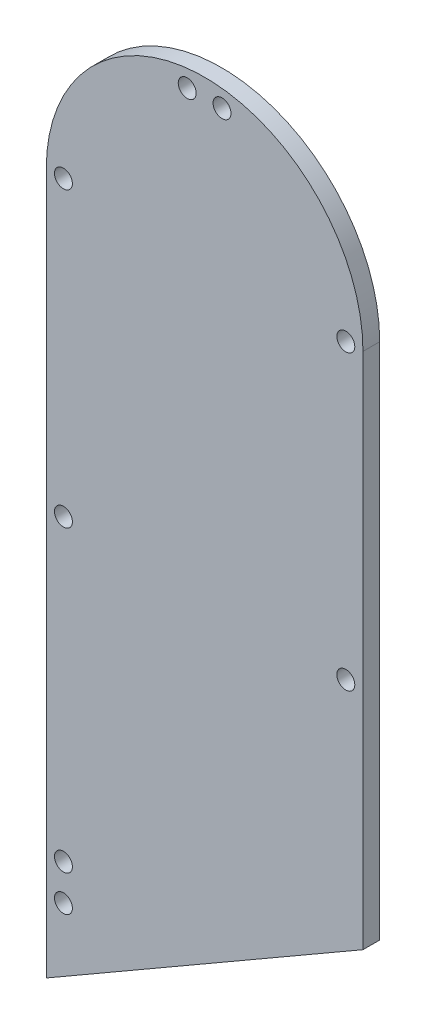
ISO-10303-21;
HEADER;
FILE_DESCRIPTION(('STEP AP214'),'2;1');
FILE_NAME('part.step','',(''),(''),'','','');
FILE_SCHEMA(('AUTOMOTIVE_DESIGN { 1 0 10303 214 1 1 1 1 }'));
ENDSEC;
DATA;
#1=APPLICATION_CONTEXT('core data for automotive mechanical design processes');
#2=APPLICATION_PROTOCOL_DEFINITION('international standard','automotive_design',2000,#1);
#3=PRODUCT_CONTEXT('',#1,'mechanical');
#4=PRODUCT('Part','Part','',(#3));
#5=PRODUCT_RELATED_PRODUCT_CATEGORY('part','',(#4));
#6=PRODUCT_DEFINITION_FORMATION('','',#4);
#7=PRODUCT_DEFINITION_CONTEXT('part definition',#1,'design');
#8=PRODUCT_DEFINITION('design','',#6,#7);
#9=PRODUCT_DEFINITION_SHAPE('','',#8);
#10=(LENGTH_UNIT() NAMED_UNIT(*) SI_UNIT(.MILLI.,.METRE.));
#11=(NAMED_UNIT(*) PLANE_ANGLE_UNIT() SI_UNIT($,.RADIAN.));
#12=(NAMED_UNIT(*) SI_UNIT($,.STERADIAN.) SOLID_ANGLE_UNIT());
#13=UNCERTAINTY_MEASURE_WITH_UNIT(LENGTH_MEASURE(1.E-05),#10,'distance_accuracy_value','');
#14=(GEOMETRIC_REPRESENTATION_CONTEXT(3) GLOBAL_UNCERTAINTY_ASSIGNED_CONTEXT((#13)) GLOBAL_UNIT_ASSIGNED_CONTEXT((#10,
#11,#12)) REPRESENTATION_CONTEXT('',''));
#15=CARTESIAN_POINT('',(0.,0.,0.));
#16=DIRECTION('',(0.,0.,1.));
#17=DIRECTION('',(1.,0.,0.));
#18=AXIS2_PLACEMENT_3D('',#15,#16,#17);
#19=CARTESIAN_POINT('',(24.5827179372451,-59.5829059297929,3.175));
#20=DIRECTION('',(0.,0.,1.));
#21=DIRECTION('',(1.,0.,0.));
#22=AXIS2_PLACEMENT_3D('',#19,#20,#21);
#23=PLANE('',#22);
#24=DIRECTION('',(-0.866025403784438,-0.500000000000001,0.));
#25=VECTOR('',#24,1.);
#26=CARTESIAN_POINT('',(-23.1785985762499,28.3308495887852,3.175));
#27=LINE('',#26,#25);
#28=CARTESIAN_POINT('',(54.5827179372451,73.2263666103914,3.175));
#29=VERTEX_POINT('',#28);
#30=CARTESIAN_POINT('',(-5.41728206275491,38.5853504590137,3.175));
#31=VERTEX_POINT('',#30);
#32=EDGE_CURVE('E50',#29,#31,#27,.T.);
#33=ORIENTED_EDGE('',*,*,#32,.F.);
#34=DIRECTION('',(0.,1.,0.));
#35=VECTOR('',#34,1.);
#36=CARTESIAN_POINT('',(54.5827179372451,-59.5829059297929,3.175));
#37=LINE('',#36,#35);
#38=CARTESIAN_POINT('',(54.5827179372451,171.394622999198,3.175));
#39=VERTEX_POINT('',#38);
#40=EDGE_CURVE('E93',#29,#39,#37,.T.);
#41=ORIENTED_EDGE('',*,*,#40,.T.);
#42=CARTESIAN_POINT('',(24.5827179372451,171.394622999198,3.175));
#43=DIRECTION('',(0.,0.,1.));
#44=DIRECTION('',(1.,0.,0.));
#45=AXIS2_PLACEMENT_3D('',#42,#43,#44);
#46=CIRCLE('',#45,30.);
#47=CARTESIAN_POINT('',(-5.41728206275491,171.394622999198,3.175));
#48=VERTEX_POINT('',#47);
#49=EDGE_CURVE('E58',#39,#48,#46,.T.);
#50=ORIENTED_EDGE('',*,*,#49,.T.);
#51=DIRECTION('',(0.,-1.,0.));
#52=VECTOR('',#51,1.);
#53=CARTESIAN_POINT('',(-5.41728206275491,171.394622999198,3.175));
#54=LINE('',#53,#52);
#55=EDGE_CURVE('E86',#48,#31,#54,.T.);
#56=ORIENTED_EDGE('',*,*,#55,.T.);
#57=EDGE_LOOP('',(#33,#41,#50,#56));
#58=FACE_BOUND('',#57,.T.);
#59=CARTESIAN_POINT('',(21.2827179372451,197.940291195723,3.175));
#60=DIRECTION('',(0.,0.,1.));
#61=DIRECTION('',(1.,0.,0.));
#62=AXIS2_PLACEMENT_3D('',#59,#60,#61);
#63=CIRCLE('',#62,1.70000000000001);
#64=CARTESIAN_POINT('',(22.9827179372451,197.940291195723,3.175));
#65=VERTEX_POINT('',#64);
#66=EDGE_CURVE('E134',#65,#65,#63,.T.);
#67=ORIENTED_EDGE('',*,*,#66,.F.);
#68=EDGE_LOOP('',(#67));
#69=FACE_BOUND('',#68,.T.);
#70=CARTESIAN_POINT('',(51.3327179372449,115.905858534703,3.175));
#71=DIRECTION('',(0.,0.,1.));
#72=DIRECTION('',(1.,0.,0.));
#73=AXIS2_PLACEMENT_3D('',#70,#71,#72);
#74=CIRCLE('',#73,1.70000000000001);
#75=CARTESIAN_POINT('',(53.0327179372449,115.905858534703,3.175));
#76=VERTEX_POINT('',#75);
#77=EDGE_CURVE('E122',#76,#76,#74,.T.);
#78=ORIENTED_EDGE('',*,*,#77,.F.);
#79=EDGE_LOOP('',(#78));
#80=FACE_BOUND('',#79,.T.);
#81=CARTESIAN_POINT('',(51.3327179372474,171.3946229992,3.175));
#82=DIRECTION('',(0.,0.,1.));
#83=DIRECTION('',(1.,0.,0.));
#84=AXIS2_PLACEMENT_3D('',#81,#82,#83);
#85=CIRCLE('',#84,1.70000000000001);
#86=CARTESIAN_POINT('',(53.0327179372474,171.3946229992,3.175));
#87=VERTEX_POINT('',#86);
#88=EDGE_CURVE('E104',#87,#87,#85,.T.);
#89=ORIENTED_EDGE('',*,*,#88,.F.);
#90=EDGE_LOOP('',(#89));
#91=FACE_BOUND('',#90,.T.);
#92=CARTESIAN_POINT('',(27.8827179372451,197.940291195723,3.175));
#93=DIRECTION('',(0.,0.,1.));
#94=DIRECTION('',(1.,0.,0.));
#95=AXIS2_PLACEMENT_3D('',#92,#93,#94);
#96=CIRCLE('',#95,1.70000000000001);
#97=CARTESIAN_POINT('',(29.5827179372451,197.940291195723,3.175));
#98=VERTEX_POINT('',#97);
#99=EDGE_CURVE('E98',#98,#98,#96,.T.);
#100=ORIENTED_EDGE('',*,*,#99,.F.);
#101=EDGE_LOOP('',(#100));
#102=FACE_BOUND('',#101,.T.);
#103=CARTESIAN_POINT('',(-2.1672820627549,59.3058585347025,3.175));
#104=DIRECTION('',(0.,0.,1.));
#105=DIRECTION('',(1.,0.,0.));
#106=AXIS2_PLACEMENT_3D('',#103,#104,#105);
#107=CIRCLE('',#106,1.70000000000001);
#108=CARTESIAN_POINT('',(-0.46728206275489,59.3058585347025,3.175));
#109=VERTEX_POINT('',#108);
#110=EDGE_CURVE('E110',#109,#109,#107,.T.);
#111=ORIENTED_EDGE('',*,*,#110,.F.);
#112=EDGE_LOOP('',(#111));
#113=FACE_BOUND('',#112,.T.);
#114=CARTESIAN_POINT('',(-2.16728206275266,171.394622999196,3.175));
#115=DIRECTION('',(0.,0.,1.));
#116=DIRECTION('',(1.,0.,0.));
#117=AXIS2_PLACEMENT_3D('',#114,#115,#116);
#118=CIRCLE('',#117,1.70000000000001);
#119=CARTESIAN_POINT('',(-0.467282062752642,171.394622999196,3.175));
#120=VERTEX_POINT('',#119);
#121=EDGE_CURVE('E116',#120,#120,#118,.T.);
#122=ORIENTED_EDGE('',*,*,#121,.F.);
#123=EDGE_LOOP('',(#122));
#124=FACE_BOUND('',#123,.T.);
#125=CARTESIAN_POINT('',(-2.16728206275513,115.905858534703,3.175));
#126=DIRECTION('',(0.,0.,1.));
#127=DIRECTION('',(1.,0.,0.));
#128=AXIS2_PLACEMENT_3D('',#125,#126,#127);
#129=CIRCLE('',#128,1.70000000000001);
#130=CARTESIAN_POINT('',(-0.467282062755112,115.905858534703,3.175));
#131=VERTEX_POINT('',#130);
#132=EDGE_CURVE('E128',#131,#131,#129,.T.);
#133=ORIENTED_EDGE('',*,*,#132,.F.);
#134=EDGE_LOOP('',(#133));
#135=FACE_BOUND('',#134,.T.);
#136=CARTESIAN_POINT('',(-2.1672820627549,52.5058585347025,3.175));
#137=DIRECTION('',(0.,0.,1.));
#138=DIRECTION('',(1.,0.,0.));
#139=AXIS2_PLACEMENT_3D('',#136,#137,#138);
#140=CIRCLE('',#139,1.70000000000001);
#141=CARTESIAN_POINT('',(-0.46728206275489,52.5058585347025,3.175));
#142=VERTEX_POINT('',#141);
#143=EDGE_CURVE('E140',#142,#142,#140,.T.);
#144=ORIENTED_EDGE('',*,*,#143,.F.);
#145=EDGE_LOOP('',(#144));
#146=FACE_BOUND('',#145,.T.);
#147=ADVANCED_FACE('F35',(#58,#69,#80,#91,#102,#113,#124,#135,#146),#23,.T.);
#148=CARTESIAN_POINT('',(24.5827179372451,-59.5829059297929,0.));
#149=DIRECTION('',(0.,0.,1.));
#150=DIRECTION('',(1.,0.,0.));
#151=AXIS2_PLACEMENT_3D('',#148,#149,#150);
#152=PLANE('',#151);
#153=DIRECTION('',(0.,1.,0.));
#154=VECTOR('',#153,1.);
#155=CARTESIAN_POINT('',(54.5827179372451,-59.5829059297929,0.));
#156=LINE('',#155,#154);
#157=CARTESIAN_POINT('',(54.5827179372451,73.2263666103914,0.));
#158=VERTEX_POINT('',#157);
#159=CARTESIAN_POINT('',(54.5827179372451,171.394622999198,0.));
#160=VERTEX_POINT('',#159);
#161=EDGE_CURVE('E81',#158,#160,#156,.T.);
#162=ORIENTED_EDGE('',*,*,#161,.F.);
#163=DIRECTION('',(-0.866025403784438,-0.500000000000001,0.));
#164=VECTOR('',#163,1.);
#165=CARTESIAN_POINT('',(-23.1785985762499,28.3308495887852,0.));
#166=LINE('',#165,#164);
#167=CARTESIAN_POINT('',(-5.41728206275491,38.5853504590137,0.));
#168=VERTEX_POINT('',#167);
#169=EDGE_CURVE('E92',#158,#168,#166,.T.);
#170=ORIENTED_EDGE('',*,*,#169,.T.);
#171=DIRECTION('',(0.,-1.,0.));
#172=VECTOR('',#171,1.);
#173=CARTESIAN_POINT('',(-5.41728206275491,171.394622999198,0.));
#174=LINE('',#173,#172);
#175=CARTESIAN_POINT('',(-5.41728206275491,171.394622999198,0.));
#176=VERTEX_POINT('',#175);
#177=EDGE_CURVE('E80',#176,#168,#174,.T.);
#178=ORIENTED_EDGE('',*,*,#177,.F.);
#179=CARTESIAN_POINT('',(24.5827179372451,171.394622999198,0.));
#180=DIRECTION('',(0.,0.,1.));
#181=DIRECTION('',(1.,0.,0.));
#182=AXIS2_PLACEMENT_3D('',#179,#180,#181);
#183=CIRCLE('',#182,30.);
#184=EDGE_CURVE('E71',#160,#176,#183,.T.);
#185=ORIENTED_EDGE('',*,*,#184,.F.);
#186=EDGE_LOOP('',(#162,#170,#178,#185));
#187=FACE_BOUND('',#186,.T.);
#188=CARTESIAN_POINT('',(27.8827179372451,197.940291195723,0.));
#189=DIRECTION('',(0.,0.,1.));
#190=DIRECTION('',(1.,0.,0.));
#191=AXIS2_PLACEMENT_3D('',#188,#189,#190);
#192=CIRCLE('',#191,1.70000000000001);
#193=CARTESIAN_POINT('',(29.5827179372451,197.940291195723,0.));
#194=VERTEX_POINT('',#193);
#195=EDGE_CURVE('E101',#194,#194,#192,.T.);
#196=ORIENTED_EDGE('',*,*,#195,.T.);
#197=EDGE_LOOP('',(#196));
#198=FACE_BOUND('',#197,.T.);
#199=CARTESIAN_POINT('',(51.3327179372474,171.3946229992,0.));
#200=DIRECTION('',(0.,0.,1.));
#201=DIRECTION('',(1.,0.,0.));
#202=AXIS2_PLACEMENT_3D('',#199,#200,#201);
#203=CIRCLE('',#202,1.70000000000001);
#204=CARTESIAN_POINT('',(53.0327179372474,171.3946229992,0.));
#205=VERTEX_POINT('',#204);
#206=EDGE_CURVE('E107',#205,#205,#203,.T.);
#207=ORIENTED_EDGE('',*,*,#206,.T.);
#208=EDGE_LOOP('',(#207));
#209=FACE_BOUND('',#208,.T.);
#210=CARTESIAN_POINT('',(-2.1672820627549,59.3058585347025,0.));
#211=DIRECTION('',(0.,0.,1.));
#212=DIRECTION('',(1.,0.,0.));
#213=AXIS2_PLACEMENT_3D('',#210,#211,#212);
#214=CIRCLE('',#213,1.70000000000001);
#215=CARTESIAN_POINT('',(-0.46728206275489,59.3058585347025,0.));
#216=VERTEX_POINT('',#215);
#217=EDGE_CURVE('E113',#216,#216,#214,.T.);
#218=ORIENTED_EDGE('',*,*,#217,.T.);
#219=EDGE_LOOP('',(#218));
#220=FACE_BOUND('',#219,.T.);
#221=CARTESIAN_POINT('',(-2.16728206275266,171.394622999196,0.));
#222=DIRECTION('',(0.,0.,1.));
#223=DIRECTION('',(1.,0.,0.));
#224=AXIS2_PLACEMENT_3D('',#221,#222,#223);
#225=CIRCLE('',#224,1.70000000000001);
#226=CARTESIAN_POINT('',(-0.467282062752642,171.394622999196,0.));
#227=VERTEX_POINT('',#226);
#228=EDGE_CURVE('E119',#227,#227,#225,.T.);
#229=ORIENTED_EDGE('',*,*,#228,.T.);
#230=EDGE_LOOP('',(#229));
#231=FACE_BOUND('',#230,.T.);
#232=CARTESIAN_POINT('',(51.3327179372449,115.905858534703,0.));
#233=DIRECTION('',(0.,0.,1.));
#234=DIRECTION('',(1.,0.,0.));
#235=AXIS2_PLACEMENT_3D('',#232,#233,#234);
#236=CIRCLE('',#235,1.70000000000001);
#237=CARTESIAN_POINT('',(53.0327179372449,115.905858534703,0.));
#238=VERTEX_POINT('',#237);
#239=EDGE_CURVE('E125',#238,#238,#236,.T.);
#240=ORIENTED_EDGE('',*,*,#239,.T.);
#241=EDGE_LOOP('',(#240));
#242=FACE_BOUND('',#241,.T.);
#243=CARTESIAN_POINT('',(-2.16728206275513,115.905858534703,0.));
#244=DIRECTION('',(0.,0.,1.));
#245=DIRECTION('',(1.,0.,0.));
#246=AXIS2_PLACEMENT_3D('',#243,#244,#245);
#247=CIRCLE('',#246,1.70000000000001);
#248=CARTESIAN_POINT('',(-0.467282062755112,115.905858534703,0.));
#249=VERTEX_POINT('',#248);
#250=EDGE_CURVE('E131',#249,#249,#247,.T.);
#251=ORIENTED_EDGE('',*,*,#250,.T.);
#252=EDGE_LOOP('',(#251));
#253=FACE_BOUND('',#252,.T.);
#254=CARTESIAN_POINT('',(21.2827179372451,197.940291195723,0.));
#255=DIRECTION('',(0.,0.,1.));
#256=DIRECTION('',(1.,0.,0.));
#257=AXIS2_PLACEMENT_3D('',#254,#255,#256);
#258=CIRCLE('',#257,1.70000000000001);
#259=CARTESIAN_POINT('',(22.9827179372451,197.940291195723,0.));
#260=VERTEX_POINT('',#259);
#261=EDGE_CURVE('E137',#260,#260,#258,.T.);
#262=ORIENTED_EDGE('',*,*,#261,.T.);
#263=EDGE_LOOP('',(#262));
#264=FACE_BOUND('',#263,.T.);
#265=CARTESIAN_POINT('',(-2.1672820627549,52.5058585347025,0.));
#266=DIRECTION('',(0.,0.,1.));
#267=DIRECTION('',(1.,0.,0.));
#268=AXIS2_PLACEMENT_3D('',#265,#266,#267);
#269=CIRCLE('',#268,1.70000000000001);
#270=CARTESIAN_POINT('',(-0.46728206275489,52.5058585347025,0.));
#271=VERTEX_POINT('',#270);
#272=EDGE_CURVE('E143',#271,#271,#269,.T.);
#273=ORIENTED_EDGE('',*,*,#272,.T.);
#274=EDGE_LOOP('',(#273));
#275=FACE_BOUND('',#274,.T.);
#276=ADVANCED_FACE('F89',(#187,#198,#209,#220,#231,#242,#253,#264,#275),#152,.F.);
#277=CARTESIAN_POINT('',(54.5827179372451,-59.5829059297929,3.175));
#278=DIRECTION('',(-1.,0.,0.));
#279=DIRECTION('',(0.,0.,1.));
#280=AXIS2_PLACEMENT_3D('',#277,#278,#279);
#281=PLANE('',#280);
#282=ORIENTED_EDGE('',*,*,#40,.F.);
#283=DIRECTION('',(0.,0.,-1.));
#284=VECTOR('',#283,1.);
#285=CARTESIAN_POINT('',(54.5827179372451,73.2263666103914,3.175));
#286=LINE('',#285,#284);
#287=EDGE_CURVE('E146',#29,#158,#286,.T.);
#288=ORIENTED_EDGE('',*,*,#287,.T.);
#289=ORIENTED_EDGE('',*,*,#161,.T.);
#290=DIRECTION('',(0.,0.,-1.));
#291=VECTOR('',#290,1.);
#292=CARTESIAN_POINT('',(54.5827179372451,171.394622999198,3.175));
#293=LINE('',#292,#291);
#294=EDGE_CURVE('E43',#39,#160,#293,.T.);
#295=ORIENTED_EDGE('',*,*,#294,.F.);
#296=EDGE_LOOP('',(#282,#288,#289,#295));
#297=FACE_BOUND('',#296,.T.);
#298=ADVANCED_FACE('F37',(#297),#281,.F.);
#299=CARTESIAN_POINT('',(24.5827179372451,171.394622999198,3.175));
#300=DIRECTION('',(0.,0.,-1.));
#301=DIRECTION('',(-1.,0.,0.));
#302=AXIS2_PLACEMENT_3D('',#299,#300,#301);
#303=CYLINDRICAL_SURFACE('',#302,30.);
#304=ORIENTED_EDGE('',*,*,#184,.T.);
#305=DIRECTION('',(0.,0.,-1.));
#306=VECTOR('',#305,1.);
#307=CARTESIAN_POINT('',(-5.41728206275491,171.394622999198,3.175));
#308=LINE('',#307,#306);
#309=EDGE_CURVE('E74',#48,#176,#308,.T.);
#310=ORIENTED_EDGE('',*,*,#309,.F.);
#311=ORIENTED_EDGE('',*,*,#49,.F.);
#312=ORIENTED_EDGE('',*,*,#294,.T.);
#313=EDGE_LOOP('',(#304,#310,#311,#312));
#314=FACE_BOUND('',#313,.T.);
#315=ADVANCED_FACE('F73',(#314),#303,.T.);
#316=CARTESIAN_POINT('',(-5.41728206275491,171.394622999198,3.175));
#317=DIRECTION('',(1.,0.,0.));
#318=DIRECTION('',(0.,0.,-1.));
#319=AXIS2_PLACEMENT_3D('',#316,#317,#318);
#320=PLANE('',#319);
#321=ORIENTED_EDGE('',*,*,#177,.T.);
#322=DIRECTION('',(0.,0.,1.));
#323=VECTOR('',#322,1.);
#324=CARTESIAN_POINT('',(-5.41728206275491,38.5853504590137,3.175));
#325=LINE('',#324,#323);
#326=EDGE_CURVE('E11',#168,#31,#325,.T.);
#327=ORIENTED_EDGE('',*,*,#326,.T.);
#328=ORIENTED_EDGE('',*,*,#55,.F.);
#329=ORIENTED_EDGE('',*,*,#309,.T.);
#330=EDGE_LOOP('',(#321,#327,#328,#329));
#331=FACE_BOUND('',#330,.T.);
#332=ADVANCED_FACE('F85',(#331),#320,.F.);
#333=CARTESIAN_POINT('',(27.8827179372451,197.940291195723,3.175));
#334=DIRECTION('',(0.,0.,-1.));
#335=DIRECTION('',(-1.,0.,0.));
#336=AXIS2_PLACEMENT_3D('',#333,#334,#335);
#337=CYLINDRICAL_SURFACE('',#336,1.70000000000001);
#338=ORIENTED_EDGE('',*,*,#99,.T.);
#339=EDGE_LOOP('',(#338));
#340=FACE_BOUND('',#339,.T.);
#341=ORIENTED_EDGE('',*,*,#195,.F.);
#342=EDGE_LOOP('',(#341));
#343=FACE_BOUND('',#342,.T.);
#344=ADVANCED_FACE('F193',(#340,#343),#337,.F.);
#345=CARTESIAN_POINT('',(51.3327179372474,171.3946229992,3.175));
#346=DIRECTION('',(0.,0.,-1.));
#347=DIRECTION('',(-1.,0.,0.));
#348=AXIS2_PLACEMENT_3D('',#345,#346,#347);
#349=CYLINDRICAL_SURFACE('',#348,1.70000000000001);
#350=ORIENTED_EDGE('',*,*,#88,.T.);
#351=EDGE_LOOP('',(#350));
#352=FACE_BOUND('',#351,.T.);
#353=ORIENTED_EDGE('',*,*,#206,.F.);
#354=EDGE_LOOP('',(#353));
#355=FACE_BOUND('',#354,.T.);
#356=ADVANCED_FACE('F210',(#352,#355),#349,.F.);
#357=CARTESIAN_POINT('',(-2.1672820627549,59.3058585347025,3.175));
#358=DIRECTION('',(0.,0.,-1.));
#359=DIRECTION('',(-1.,0.,0.));
#360=AXIS2_PLACEMENT_3D('',#357,#358,#359);
#361=CYLINDRICAL_SURFACE('',#360,1.70000000000001);
#362=ORIENTED_EDGE('',*,*,#110,.T.);
#363=EDGE_LOOP('',(#362));
#364=FACE_BOUND('',#363,.T.);
#365=ORIENTED_EDGE('',*,*,#217,.F.);
#366=EDGE_LOOP('',(#365));
#367=FACE_BOUND('',#366,.T.);
#368=ADVANCED_FACE('F217',(#364,#367),#361,.F.);
#369=CARTESIAN_POINT('',(-2.16728206275266,171.394622999196,3.175));
#370=DIRECTION('',(0.,0.,-1.));
#371=DIRECTION('',(-1.,0.,0.));
#372=AXIS2_PLACEMENT_3D('',#369,#370,#371);
#373=CYLINDRICAL_SURFACE('',#372,1.70000000000001);
#374=ORIENTED_EDGE('',*,*,#121,.T.);
#375=EDGE_LOOP('',(#374));
#376=FACE_BOUND('',#375,.T.);
#377=ORIENTED_EDGE('',*,*,#228,.F.);
#378=EDGE_LOOP('',(#377));
#379=FACE_BOUND('',#378,.T.);
#380=ADVANCED_FACE('F225',(#376,#379),#373,.F.);
#381=CARTESIAN_POINT('',(51.3327179372449,115.905858534703,3.175));
#382=DIRECTION('',(0.,0.,-1.));
#383=DIRECTION('',(-1.,0.,0.));
#384=AXIS2_PLACEMENT_3D('',#381,#382,#383);
#385=CYLINDRICAL_SURFACE('',#384,1.70000000000001);
#386=ORIENTED_EDGE('',*,*,#77,.T.);
#387=EDGE_LOOP('',(#386));
#388=FACE_BOUND('',#387,.T.);
#389=ORIENTED_EDGE('',*,*,#239,.F.);
#390=EDGE_LOOP('',(#389));
#391=FACE_BOUND('',#390,.T.);
#392=ADVANCED_FACE('F233',(#388,#391),#385,.F.);
#393=CARTESIAN_POINT('',(-2.16728206275513,115.905858534703,3.175));
#394=DIRECTION('',(0.,0.,-1.));
#395=DIRECTION('',(-1.,0.,0.));
#396=AXIS2_PLACEMENT_3D('',#393,#394,#395);
#397=CYLINDRICAL_SURFACE('',#396,1.70000000000001);
#398=ORIENTED_EDGE('',*,*,#132,.T.);
#399=EDGE_LOOP('',(#398));
#400=FACE_BOUND('',#399,.T.);
#401=ORIENTED_EDGE('',*,*,#250,.F.);
#402=EDGE_LOOP('',(#401));
#403=FACE_BOUND('',#402,.T.);
#404=ADVANCED_FACE('F241',(#400,#403),#397,.F.);
#405=CARTESIAN_POINT('',(21.2827179372451,197.940291195723,3.175));
#406=DIRECTION('',(0.,0.,-1.));
#407=DIRECTION('',(-1.,0.,0.));
#408=AXIS2_PLACEMENT_3D('',#405,#406,#407);
#409=CYLINDRICAL_SURFACE('',#408,1.70000000000001);
#410=ORIENTED_EDGE('',*,*,#66,.T.);
#411=EDGE_LOOP('',(#410));
#412=FACE_BOUND('',#411,.T.);
#413=ORIENTED_EDGE('',*,*,#261,.F.);
#414=EDGE_LOOP('',(#413));
#415=FACE_BOUND('',#414,.T.);
#416=ADVANCED_FACE('F181',(#412,#415),#409,.F.);
#417=CARTESIAN_POINT('',(-2.1672820627549,52.5058585347025,3.175));
#418=DIRECTION('',(0.,0.,-1.));
#419=DIRECTION('',(-1.,0.,0.));
#420=AXIS2_PLACEMENT_3D('',#417,#418,#419);
#421=CYLINDRICAL_SURFACE('',#420,1.70000000000001);
#422=ORIENTED_EDGE('',*,*,#143,.T.);
#423=EDGE_LOOP('',(#422));
#424=FACE_BOUND('',#423,.T.);
#425=ORIENTED_EDGE('',*,*,#272,.F.);
#426=EDGE_LOOP('',(#425));
#427=FACE_BOUND('',#426,.T.);
#428=ADVANCED_FACE('F178',(#424,#427),#421,.F.);
#429=CARTESIAN_POINT('',(-23.1785985762499,28.3308495887852,0.));
#430=DIRECTION('',(-0.500000000000001,0.866025403784438,0.));
#431=DIRECTION('',(-0.866025403784438,-0.500000000000002,0.));
#432=AXIS2_PLACEMENT_3D('',#429,#430,#431);
#433=PLANE('',#432);
#434=ORIENTED_EDGE('',*,*,#32,.T.);
#435=ORIENTED_EDGE('',*,*,#326,.F.);
#436=ORIENTED_EDGE('',*,*,#169,.F.);
#437=ORIENTED_EDGE('',*,*,#287,.F.);
#438=EDGE_LOOP('',(#434,#435,#436,#437));
#439=FACE_BOUND('',#438,.T.);
#440=ADVANCED_FACE('F157',(#439),#433,.F.);
#441=CLOSED_SHELL('',(#147,#276,#298,#315,#332,#344,#356,#368,#380,#392,#404,#416,#428,#440));
#442=MANIFOLD_SOLID_BREP('B2',#441);
#443=ADVANCED_BREP_SHAPE_REPRESENTATION('',(#18,#442),#14);
#444=SHAPE_DEFINITION_REPRESENTATION(#9,#443);
ENDSEC;
END-ISO-10303-21;
